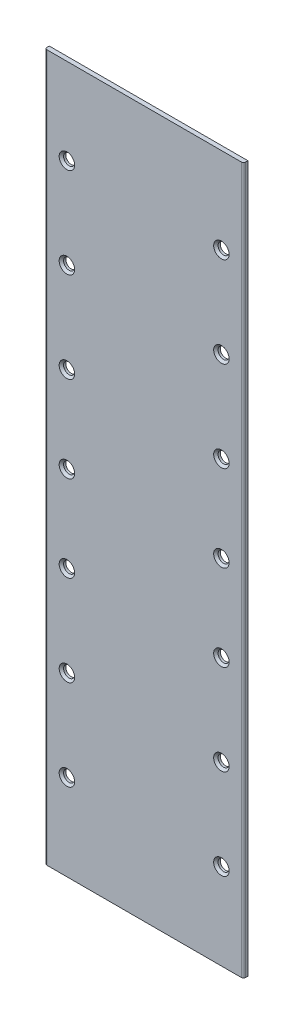
ISO-10303-21;
HEADER;
FILE_DESCRIPTION(('STEP AP214'),'2;1');
FILE_NAME('part.step','',(''),(''),'','','');
FILE_SCHEMA(('AUTOMOTIVE_DESIGN { 1 0 10303 214 1 1 1 1 }'));
ENDSEC;
DATA;
#1=APPLICATION_CONTEXT('core data for automotive mechanical design processes');
#2=APPLICATION_PROTOCOL_DEFINITION('international standard','automotive_design',2000,#1);
#3=PRODUCT_CONTEXT('',#1,'mechanical');
#4=PRODUCT('Part','Part','',(#3));
#5=PRODUCT_RELATED_PRODUCT_CATEGORY('part','',(#4));
#6=PRODUCT_DEFINITION_FORMATION('','',#4);
#7=PRODUCT_DEFINITION_CONTEXT('part definition',#1,'design');
#8=PRODUCT_DEFINITION('design','',#6,#7);
#9=PRODUCT_DEFINITION_SHAPE('','',#8);
#10=(LENGTH_UNIT() NAMED_UNIT(*) SI_UNIT(.MILLI.,.METRE.));
#11=(NAMED_UNIT(*) PLANE_ANGLE_UNIT() SI_UNIT($,.RADIAN.));
#12=(NAMED_UNIT(*) SI_UNIT($,.STERADIAN.) SOLID_ANGLE_UNIT());
#13=UNCERTAINTY_MEASURE_WITH_UNIT(LENGTH_MEASURE(1.E-05),#10,'distance_accuracy_value','');
#14=(GEOMETRIC_REPRESENTATION_CONTEXT(3) GLOBAL_UNCERTAINTY_ASSIGNED_CONTEXT((#13)) GLOBAL_UNIT_ASSIGNED_CONTEXT((#10,
#11,#12)) REPRESENTATION_CONTEXT('',''));
#15=CARTESIAN_POINT('',(0.,0.,0.));
#16=DIRECTION('',(0.,0.,1.));
#17=DIRECTION('',(1.,0.,0.));
#18=AXIS2_PLACEMENT_3D('',#15,#16,#17);
#19=CARTESIAN_POINT('',(0.,0.,2.));
#20=DIRECTION('',(0.,0.,-1.));
#21=DIRECTION('',(-1.,0.,0.));
#22=AXIS2_PLACEMENT_3D('',#19,#20,#21);
#23=PLANE('',#22);
#24=CARTESIAN_POINT('',(34.9999999999999,120.982014682888,2.));
#25=DIRECTION('',(0.,0.,-1.));
#26=DIRECTION('',(-1.,0.,0.));
#27=AXIS2_PLACEMENT_3D('',#24,#25,#26);
#28=CIRCLE('',#27,3.49999999999998);
#29=CARTESIAN_POINT('',(31.5,120.982014682888,2.));
#30=VERTEX_POINT('',#29);
#31=EDGE_CURVE('E275',#30,#30,#28,.T.);
#32=ORIENTED_EDGE('',*,*,#31,.T.);
#33=EDGE_LOOP('',(#32));
#34=FACE_BOUND('',#33,.T.);
#35=CARTESIAN_POINT('',(35.,80.,2.));
#36=DIRECTION('',(0.,0.,-1.));
#37=DIRECTION('',(-1.,0.,0.));
#38=AXIS2_PLACEMENT_3D('',#35,#36,#37);
#39=CIRCLE('',#38,3.49999999999998);
#40=CARTESIAN_POINT('',(31.5,80.,2.));
#41=VERTEX_POINT('',#40);
#42=EDGE_CURVE('E271',#41,#41,#39,.T.);
#43=ORIENTED_EDGE('',*,*,#42,.T.);
#44=EDGE_LOOP('',(#43));
#45=FACE_BOUND('',#44,.T.);
#46=CARTESIAN_POINT('',(34.9999999999999,39.0179853171119,2.));
#47=DIRECTION('',(0.,0.,-1.));
#48=DIRECTION('',(-1.,0.,0.));
#49=AXIS2_PLACEMENT_3D('',#46,#47,#48);
#50=CIRCLE('',#49,3.49999999999998);
#51=CARTESIAN_POINT('',(31.5,39.0179853171119,2.));
#52=VERTEX_POINT('',#51);
#53=EDGE_CURVE('E267',#52,#52,#50,.T.);
#54=ORIENTED_EDGE('',*,*,#53,.T.);
#55=EDGE_LOOP('',(#54));
#56=FACE_BOUND('',#55,.T.);
#57=CARTESIAN_POINT('',(35.,0.,2.));
#58=DIRECTION('',(0.,0.,-1.));
#59=DIRECTION('',(-1.,0.,0.));
#60=AXIS2_PLACEMENT_3D('',#57,#58,#59);
#61=CIRCLE('',#60,3.49999999999998);
#62=CARTESIAN_POINT('',(31.5,0.,2.));
#63=VERTEX_POINT('',#62);
#64=EDGE_CURVE('E263',#63,#63,#61,.T.);
#65=ORIENTED_EDGE('',*,*,#64,.T.);
#66=EDGE_LOOP('',(#65));
#67=FACE_BOUND('',#66,.T.);
#68=CARTESIAN_POINT('',(35.,-39.0179853171119,2.));
#69=DIRECTION('',(0.,0.,-1.));
#70=DIRECTION('',(-1.,0.,0.));
#71=AXIS2_PLACEMENT_3D('',#68,#69,#70);
#72=CIRCLE('',#71,3.49999999999998);
#73=CARTESIAN_POINT('',(31.5,-39.0179853171119,2.));
#74=VERTEX_POINT('',#73);
#75=EDGE_CURVE('E259',#74,#74,#72,.T.);
#76=ORIENTED_EDGE('',*,*,#75,.T.);
#77=EDGE_LOOP('',(#76));
#78=FACE_BOUND('',#77,.T.);
#79=CARTESIAN_POINT('',(35.,-80.,2.));
#80=DIRECTION('',(0.,0.,-1.));
#81=DIRECTION('',(-1.,0.,0.));
#82=AXIS2_PLACEMENT_3D('',#79,#80,#81);
#83=CIRCLE('',#82,3.49999999999998);
#84=CARTESIAN_POINT('',(31.5,-80.,2.));
#85=VERTEX_POINT('',#84);
#86=EDGE_CURVE('E255',#85,#85,#83,.T.);
#87=ORIENTED_EDGE('',*,*,#86,.T.);
#88=EDGE_LOOP('',(#87));
#89=FACE_BOUND('',#88,.T.);
#90=CARTESIAN_POINT('',(35.,-120.982014682888,2.));
#91=DIRECTION('',(0.,0.,-1.));
#92=DIRECTION('',(-1.,0.,0.));
#93=AXIS2_PLACEMENT_3D('',#90,#91,#92);
#94=CIRCLE('',#93,3.49999999999998);
#95=CARTESIAN_POINT('',(31.5,-120.982014682888,2.));
#96=VERTEX_POINT('',#95);
#97=EDGE_CURVE('E251',#96,#96,#94,.T.);
#98=ORIENTED_EDGE('',*,*,#97,.T.);
#99=EDGE_LOOP('',(#98));
#100=FACE_BOUND('',#99,.T.);
#101=CARTESIAN_POINT('',(-34.9999999999999,120.982014682888,2.));
#102=DIRECTION('',(0.,0.,-1.));
#103=DIRECTION('',(-1.,0.,0.));
#104=AXIS2_PLACEMENT_3D('',#101,#102,#103);
#105=CIRCLE('',#104,3.49999999999998);
#106=CARTESIAN_POINT('',(-38.4999999999999,120.982014682888,2.));
#107=VERTEX_POINT('',#106);
#108=EDGE_CURVE('E247',#107,#107,#105,.T.);
#109=ORIENTED_EDGE('',*,*,#108,.T.);
#110=EDGE_LOOP('',(#109));
#111=FACE_BOUND('',#110,.T.);
#112=CARTESIAN_POINT('',(-35.,80.,2.));
#113=DIRECTION('',(0.,0.,-1.));
#114=DIRECTION('',(-1.,0.,0.));
#115=AXIS2_PLACEMENT_3D('',#112,#113,#114);
#116=CIRCLE('',#115,3.49999999999998);
#117=CARTESIAN_POINT('',(-38.4999999999999,80.,2.));
#118=VERTEX_POINT('',#117);
#119=EDGE_CURVE('E243',#118,#118,#116,.T.);
#120=ORIENTED_EDGE('',*,*,#119,.T.);
#121=EDGE_LOOP('',(#120));
#122=FACE_BOUND('',#121,.T.);
#123=CARTESIAN_POINT('',(-34.9999999999999,39.0179853171119,2.));
#124=DIRECTION('',(0.,0.,-1.));
#125=DIRECTION('',(-1.,0.,0.));
#126=AXIS2_PLACEMENT_3D('',#123,#124,#125);
#127=CIRCLE('',#126,3.49999999999998);
#128=CARTESIAN_POINT('',(-38.4999999999999,39.0179853171119,2.));
#129=VERTEX_POINT('',#128);
#130=EDGE_CURVE('E239',#129,#129,#127,.T.);
#131=ORIENTED_EDGE('',*,*,#130,.T.);
#132=EDGE_LOOP('',(#131));
#133=FACE_BOUND('',#132,.T.);
#134=CARTESIAN_POINT('',(-35.,0.,2.));
#135=DIRECTION('',(0.,0.,-1.));
#136=DIRECTION('',(-1.,0.,0.));
#137=AXIS2_PLACEMENT_3D('',#134,#135,#136);
#138=CIRCLE('',#137,3.49999999999998);
#139=CARTESIAN_POINT('',(-38.4999999999999,0.,2.));
#140=VERTEX_POINT('',#139);
#141=EDGE_CURVE('E235',#140,#140,#138,.T.);
#142=ORIENTED_EDGE('',*,*,#141,.T.);
#143=EDGE_LOOP('',(#142));
#144=FACE_BOUND('',#143,.T.);
#145=CARTESIAN_POINT('',(-35.,-39.0179853171119,2.));
#146=DIRECTION('',(0.,0.,-1.));
#147=DIRECTION('',(-1.,0.,0.));
#148=AXIS2_PLACEMENT_3D('',#145,#146,#147);
#149=CIRCLE('',#148,3.49999999999998);
#150=CARTESIAN_POINT('',(-38.4999999999999,-39.0179853171119,2.));
#151=VERTEX_POINT('',#150);
#152=EDGE_CURVE('E231',#151,#151,#149,.T.);
#153=ORIENTED_EDGE('',*,*,#152,.T.);
#154=EDGE_LOOP('',(#153));
#155=FACE_BOUND('',#154,.T.);
#156=CARTESIAN_POINT('',(-35.,-80.,2.));
#157=DIRECTION('',(0.,0.,-1.));
#158=DIRECTION('',(-1.,0.,0.));
#159=AXIS2_PLACEMENT_3D('',#156,#157,#158);
#160=CIRCLE('',#159,3.49999999999998);
#161=CARTESIAN_POINT('',(-38.4999999999999,-80.,2.));
#162=VERTEX_POINT('',#161);
#163=EDGE_CURVE('E227',#162,#162,#160,.T.);
#164=ORIENTED_EDGE('',*,*,#163,.T.);
#165=EDGE_LOOP('',(#164));
#166=FACE_BOUND('',#165,.T.);
#167=CARTESIAN_POINT('',(-35.,-120.982014682888,2.));
#168=DIRECTION('',(0.,0.,-1.));
#169=DIRECTION('',(-1.,0.,0.));
#170=AXIS2_PLACEMENT_3D('',#167,#168,#169);
#171=CIRCLE('',#170,3.49999999999998);
#172=CARTESIAN_POINT('',(-38.4999999999999,-120.982014682888,2.));
#173=VERTEX_POINT('',#172);
#174=EDGE_CURVE('E223',#173,#173,#171,.T.);
#175=ORIENTED_EDGE('',*,*,#174,.T.);
#176=EDGE_LOOP('',(#175));
#177=FACE_BOUND('',#176,.T.);
#178=DIRECTION('',(-1.,0.,0.));
#179=VECTOR('',#178,1.);
#180=CARTESIAN_POINT('',(45.,160.,2.));
#181=LINE('',#180,#179);
#182=CARTESIAN_POINT('',(44.,160.,2.));
#183=VERTEX_POINT('',#182);
#184=CARTESIAN_POINT('',(-44.,160.,2.));
#185=VERTEX_POINT('',#184);
#186=EDGE_CURVE('E134',#183,#185,#181,.T.);
#187=ORIENTED_EDGE('',*,*,#186,.T.);
#188=DIRECTION('',(0.,-1.,0.));
#189=VECTOR('',#188,1.);
#190=CARTESIAN_POINT('',(-44.,0.,2.));
#191=LINE('',#190,#189);
#192=CARTESIAN_POINT('',(-43.9999999999999,-160.,2.));
#193=VERTEX_POINT('',#192);
#194=EDGE_CURVE('E204',#185,#193,#191,.T.);
#195=ORIENTED_EDGE('',*,*,#194,.T.);
#196=DIRECTION('',(1.,0.,0.));
#197=VECTOR('',#196,1.);
#198=CARTESIAN_POINT('',(45.,-160.,2.));
#199=LINE('',#198,#197);
#200=CARTESIAN_POINT('',(44.,-160.,2.));
#201=VERTEX_POINT('',#200);
#202=EDGE_CURVE('E142',#193,#201,#199,.T.);
#203=ORIENTED_EDGE('',*,*,#202,.T.);
#204=DIRECTION('',(0.,1.,0.));
#205=VECTOR('',#204,1.);
#206=CARTESIAN_POINT('',(44.,0.,2.));
#207=LINE('',#206,#205);
#208=EDGE_CURVE('E110',#201,#183,#207,.T.);
#209=ORIENTED_EDGE('',*,*,#208,.T.);
#210=EDGE_LOOP('',(#187,#195,#203,#209));
#211=FACE_BOUND('',#210,.T.);
#212=ADVANCED_FACE('F45',(#34,#45,#56,#67,#78,#89,#100,#111,#122,#133,#144,#155,#166,#177,#211),
#23,.F.);
#213=CARTESIAN_POINT('',(0.,0.,0.));
#214=DIRECTION('',(0.,0.,-1.));
#215=DIRECTION('',(-1.,0.,0.));
#216=AXIS2_PLACEMENT_3D('',#213,#214,#215);
#217=PLANE('',#216);
#218=CARTESIAN_POINT('',(-35.,-39.0179853171119,0.));
#219=DIRECTION('',(0.,0.,-1.));
#220=DIRECTION('',(-1.,0.,0.));
#221=AXIS2_PLACEMENT_3D('',#218,#219,#220);
#222=CIRCLE('',#221,2.5);
#223=CARTESIAN_POINT('',(-37.5,-39.0179853171119,0.));
#224=VERTEX_POINT('',#223);
#225=EDGE_CURVE('E127',#224,#224,#222,.T.);
#226=ORIENTED_EDGE('',*,*,#225,.F.);
#227=EDGE_LOOP('',(#226));
#228=FACE_BOUND('',#227,.T.);
#229=CARTESIAN_POINT('',(-34.9999999999999,39.0179853171119,0.));
#230=DIRECTION('',(0.,0.,-1.));
#231=DIRECTION('',(-1.,0.,0.));
#232=AXIS2_PLACEMENT_3D('',#229,#230,#231);
#233=CIRCLE('',#232,2.5);
#234=CARTESIAN_POINT('',(-37.4999999999999,39.0179853171119,0.));
#235=VERTEX_POINT('',#234);
#236=EDGE_CURVE('E186',#235,#235,#233,.F.);
#237=ORIENTED_EDGE('',*,*,#236,.T.);
#238=EDGE_LOOP('',(#237));
#239=FACE_BOUND('',#238,.T.);
#240=CARTESIAN_POINT('',(-35.,80.,0.));
#241=DIRECTION('',(0.,0.,-1.));
#242=DIRECTION('',(-1.,0.,0.));
#243=AXIS2_PLACEMENT_3D('',#240,#241,#242);
#244=CIRCLE('',#243,2.49999999999998);
#245=CARTESIAN_POINT('',(-37.4999999999999,80.,0.));
#246=VERTEX_POINT('',#245);
#247=EDGE_CURVE('E182',#246,#246,#244,.T.);
#248=ORIENTED_EDGE('',*,*,#247,.F.);
#249=EDGE_LOOP('',(#248));
#250=FACE_BOUND('',#249,.T.);
#251=CARTESIAN_POINT('',(35.,80.,0.));
#252=DIRECTION('',(0.,0.,-1.));
#253=DIRECTION('',(-1.,0.,0.));
#254=AXIS2_PLACEMENT_3D('',#251,#252,#253);
#255=CIRCLE('',#254,2.5);
#256=CARTESIAN_POINT('',(32.5,80.,0.));
#257=VERTEX_POINT('',#256);
#258=EDGE_CURVE('E178',#257,#257,#255,.T.);
#259=ORIENTED_EDGE('',*,*,#258,.F.);
#260=EDGE_LOOP('',(#259));
#261=FACE_BOUND('',#260,.T.);
#262=CARTESIAN_POINT('',(-35.,-120.982014682888,0.));
#263=DIRECTION('',(0.,0.,-1.));
#264=DIRECTION('',(-1.,0.,0.));
#265=AXIS2_PLACEMENT_3D('',#262,#263,#264);
#266=CIRCLE('',#265,2.5);
#267=CARTESIAN_POINT('',(-37.5,-120.982014682888,0.));
#268=VERTEX_POINT('',#267);
#269=EDGE_CURVE('E170',#268,#268,#266,.F.);
#270=ORIENTED_EDGE('',*,*,#269,.T.);
#271=EDGE_LOOP('',(#270));
#272=FACE_BOUND('',#271,.T.);
#273=CARTESIAN_POINT('',(-35.,-80.,0.));
#274=DIRECTION('',(0.,0.,-1.));
#275=DIRECTION('',(-1.,0.,0.));
#276=AXIS2_PLACEMENT_3D('',#273,#274,#275);
#277=CIRCLE('',#276,2.5);
#278=CARTESIAN_POINT('',(-37.5,-80.,0.));
#279=VERTEX_POINT('',#278);
#280=EDGE_CURVE('E158',#279,#279,#277,.F.);
#281=ORIENTED_EDGE('',*,*,#280,.T.);
#282=EDGE_LOOP('',(#281));
#283=FACE_BOUND('',#282,.T.);
#284=CARTESIAN_POINT('',(35.,-120.982014682888,0.));
#285=DIRECTION('',(0.,0.,-1.));
#286=DIRECTION('',(-1.,0.,0.));
#287=AXIS2_PLACEMENT_3D('',#284,#285,#286);
#288=CIRCLE('',#287,2.5);
#289=CARTESIAN_POINT('',(32.5,-120.982014682888,0.));
#290=VERTEX_POINT('',#289);
#291=EDGE_CURVE('E154',#290,#290,#288,.T.);
#292=ORIENTED_EDGE('',*,*,#291,.F.);
#293=EDGE_LOOP('',(#292));
#294=FACE_BOUND('',#293,.T.);
#295=CARTESIAN_POINT('',(-34.9999999999999,120.982014682888,0.));
#296=DIRECTION('',(0.,0.,-1.));
#297=DIRECTION('',(-1.,0.,0.));
#298=AXIS2_PLACEMENT_3D('',#295,#296,#297);
#299=CIRCLE('',#298,2.5);
#300=CARTESIAN_POINT('',(-37.4999999999999,120.982014682888,0.));
#301=VERTEX_POINT('',#300);
#302=EDGE_CURVE('E150',#301,#301,#299,.T.);
#303=ORIENTED_EDGE('',*,*,#302,.F.);
#304=EDGE_LOOP('',(#303));
#305=FACE_BOUND('',#304,.T.);
#306=DIRECTION('',(0.,-1.,0.));
#307=VECTOR('',#306,1.);
#308=CARTESIAN_POINT('',(-45.,160.,0.));
#309=LINE('',#308,#307);
#310=CARTESIAN_POINT('',(-45.,160.,0.));
#311=VERTEX_POINT('',#310);
#312=CARTESIAN_POINT('',(-45.,-160.,0.));
#313=VERTEX_POINT('',#312);
#314=EDGE_CURVE('E118',#311,#313,#309,.T.);
#315=ORIENTED_EDGE('',*,*,#314,.F.);
#316=DIRECTION('',(-1.,0.,0.));
#317=VECTOR('',#316,1.);
#318=CARTESIAN_POINT('',(45.,160.,0.));
#319=LINE('',#318,#317);
#320=CARTESIAN_POINT('',(45.,160.,0.));
#321=VERTEX_POINT('',#320);
#322=EDGE_CURVE('E139',#321,#311,#319,.T.);
#323=ORIENTED_EDGE('',*,*,#322,.F.);
#324=DIRECTION('',(0.,1.,0.));
#325=VECTOR('',#324,1.);
#326=CARTESIAN_POINT('',(45.,160.,0.));
#327=LINE('',#326,#325);
#328=CARTESIAN_POINT('',(45.,-160.,0.));
#329=VERTEX_POINT('',#328);
#330=EDGE_CURVE('E120',#329,#321,#327,.T.);
#331=ORIENTED_EDGE('',*,*,#330,.F.);
#332=DIRECTION('',(1.,0.,0.));
#333=VECTOR('',#332,1.);
#334=CARTESIAN_POINT('',(45.,-160.,0.));
#335=LINE('',#334,#333);
#336=EDGE_CURVE('E105',#313,#329,#335,.T.);
#337=ORIENTED_EDGE('',*,*,#336,.F.);
#338=EDGE_LOOP('',(#315,#323,#331,#337));
#339=FACE_BOUND('',#338,.T.);
#340=CARTESIAN_POINT('',(35.,-80.,0.));
#341=DIRECTION('',(0.,0.,-1.));
#342=DIRECTION('',(-1.,0.,0.));
#343=AXIS2_PLACEMENT_3D('',#340,#341,#342);
#344=CIRCLE('',#343,2.5);
#345=CARTESIAN_POINT('',(32.5,-80.,0.));
#346=VERTEX_POINT('',#345);
#347=EDGE_CURVE('E162',#346,#346,#344,.T.);
#348=ORIENTED_EDGE('',*,*,#347,.F.);
#349=EDGE_LOOP('',(#348));
#350=FACE_BOUND('',#349,.T.);
#351=CARTESIAN_POINT('',(35.,-39.0179853171119,0.));
#352=DIRECTION('',(0.,0.,-1.));
#353=DIRECTION('',(-1.,0.,0.));
#354=AXIS2_PLACEMENT_3D('',#351,#352,#353);
#355=CIRCLE('',#354,2.5);
#356=CARTESIAN_POINT('',(32.5,-39.0179853171119,0.));
#357=VERTEX_POINT('',#356);
#358=EDGE_CURVE('E166',#357,#357,#355,.F.);
#359=ORIENTED_EDGE('',*,*,#358,.T.);
#360=EDGE_LOOP('',(#359));
#361=FACE_BOUND('',#360,.T.);
#362=CARTESIAN_POINT('',(34.9999999999999,120.982014682888,0.));
#363=DIRECTION('',(0.,0.,-1.));
#364=DIRECTION('',(-1.,0.,0.));
#365=AXIS2_PLACEMENT_3D('',#362,#363,#364);
#366=CIRCLE('',#365,2.5);
#367=CARTESIAN_POINT('',(32.4999999999999,120.982014682888,0.));
#368=VERTEX_POINT('',#367);
#369=EDGE_CURVE('E174',#368,#368,#366,.F.);
#370=ORIENTED_EDGE('',*,*,#369,.T.);
#371=EDGE_LOOP('',(#370));
#372=FACE_BOUND('',#371,.T.);
#373=CARTESIAN_POINT('',(34.9999999999999,39.0179853171119,0.));
#374=DIRECTION('',(0.,0.,-1.));
#375=DIRECTION('',(-1.,0.,0.));
#376=AXIS2_PLACEMENT_3D('',#373,#374,#375);
#377=CIRCLE('',#376,2.5);
#378=CARTESIAN_POINT('',(32.4999999999999,39.0179853171119,0.));
#379=VERTEX_POINT('',#378);
#380=EDGE_CURVE('E190',#379,#379,#377,.T.);
#381=ORIENTED_EDGE('',*,*,#380,.F.);
#382=EDGE_LOOP('',(#381));
#383=FACE_BOUND('',#382,.T.);
#384=CARTESIAN_POINT('',(35.,0.,0.));
#385=DIRECTION('',(0.,0.,-1.));
#386=DIRECTION('',(-1.,0.,0.));
#387=AXIS2_PLACEMENT_3D('',#384,#385,#386);
#388=CIRCLE('',#387,2.5);
#389=CARTESIAN_POINT('',(32.5,0.,0.));
#390=VERTEX_POINT('',#389);
#391=EDGE_CURVE('E194',#390,#390,#388,.T.);
#392=ORIENTED_EDGE('',*,*,#391,.F.);
#393=EDGE_LOOP('',(#392));
#394=FACE_BOUND('',#393,.T.);
#395=CARTESIAN_POINT('',(-35.,0.,0.));
#396=DIRECTION('',(0.,0.,-1.));
#397=DIRECTION('',(-1.,0.,0.));
#398=AXIS2_PLACEMENT_3D('',#395,#396,#397);
#399=CIRCLE('',#398,2.5);
#400=CARTESIAN_POINT('',(-37.5,0.,0.));
#401=VERTEX_POINT('',#400);
#402=EDGE_CURVE('E131',#401,#401,#399,.F.);
#403=ORIENTED_EDGE('',*,*,#402,.T.);
#404=EDGE_LOOP('',(#403));
#405=FACE_BOUND('',#404,.T.);
#406=ADVANCED_FACE('F115',(#228,#239,#250,#261,#272,#283,#294,#305,#339,#350,#361,#372,#383,
#394,#405),#217,.T.);
#407=CARTESIAN_POINT('',(-45.,160.,2.));
#408=DIRECTION('',(1.,0.,0.));
#409=DIRECTION('',(0.,1.,0.));
#410=AXIS2_PLACEMENT_3D('',#407,#408,#409);
#411=PLANE('',#410);
#412=DIRECTION('',(0.,0.,-1.));
#413=VECTOR('',#412,1.);
#414=CARTESIAN_POINT('',(-45.,-160.,2.));
#415=LINE('',#414,#413);
#416=CARTESIAN_POINT('',(-45.,-160.,1.));
#417=VERTEX_POINT('',#416);
#418=EDGE_CURVE('E100',#417,#313,#415,.T.);
#419=ORIENTED_EDGE('',*,*,#418,.F.);
#420=DIRECTION('',(0.,-1.,0.));
#421=VECTOR('',#420,1.);
#422=CARTESIAN_POINT('',(-45.,160.,1.));
#423=LINE('',#422,#421);
#424=CARTESIAN_POINT('',(-45.,160.,1.));
#425=VERTEX_POINT('',#424);
#426=EDGE_CURVE('E70',#417,#425,#423,.F.);
#427=ORIENTED_EDGE('',*,*,#426,.T.);
#428=DIRECTION('',(0.,0.,-1.));
#429=VECTOR('',#428,1.);
#430=CARTESIAN_POINT('',(-45.,160.,2.));
#431=LINE('',#430,#429);
#432=EDGE_CURVE('E124',#425,#311,#431,.T.);
#433=ORIENTED_EDGE('',*,*,#432,.T.);
#434=ORIENTED_EDGE('',*,*,#314,.T.);
#435=EDGE_LOOP('',(#419,#427,#433,#434));
#436=FACE_BOUND('',#435,.T.);
#437=ADVANCED_FACE('F123',(#436),#411,.F.);
#438=CARTESIAN_POINT('',(45.,-160.,2.));
#439=DIRECTION('',(0.,1.,0.));
#440=DIRECTION('',(0.,0.,1.));
#441=AXIS2_PLACEMENT_3D('',#438,#439,#440);
#442=PLANE('',#441);
#443=ORIENTED_EDGE('',*,*,#202,.F.);
#444=CARTESIAN_POINT('',(-44.,-160.,1.));
#445=DIRECTION('',(0.,1.,0.));
#446=DIRECTION('',(0.,0.,1.));
#447=AXIS2_PLACEMENT_3D('',#444,#445,#446);
#448=CIRCLE('',#447,1.);
#449=EDGE_CURVE('E107',#193,#417,#448,.F.);
#450=ORIENTED_EDGE('',*,*,#449,.T.);
#451=ORIENTED_EDGE('',*,*,#418,.T.);
#452=ORIENTED_EDGE('',*,*,#336,.T.);
#453=DIRECTION('',(0.,0.,-1.));
#454=VECTOR('',#453,1.);
#455=CARTESIAN_POINT('',(45.,-160.,2.));
#456=LINE('',#455,#454);
#457=CARTESIAN_POINT('',(45.,-160.,1.));
#458=VERTEX_POINT('',#457);
#459=EDGE_CURVE('E111',#458,#329,#456,.T.);
#460=ORIENTED_EDGE('',*,*,#459,.F.);
#461=CARTESIAN_POINT('',(44.,-160.,1.));
#462=DIRECTION('',(0.,1.,0.));
#463=DIRECTION('',(0.,0.,1.));
#464=AXIS2_PLACEMENT_3D('',#461,#462,#463);
#465=CIRCLE('',#464,1.);
#466=EDGE_CURVE('E208',#458,#201,#465,.F.);
#467=ORIENTED_EDGE('',*,*,#466,.T.);
#468=EDGE_LOOP('',(#443,#450,#451,#452,#460,#467));
#469=FACE_BOUND('',#468,.T.);
#470=ADVANCED_FACE('F103',(#469),#442,.F.);
#471=CARTESIAN_POINT('',(45.,160.,2.));
#472=DIRECTION('',(-1.,0.,0.));
#473=DIRECTION('',(0.,-1.,0.));
#474=AXIS2_PLACEMENT_3D('',#471,#472,#473);
#475=PLANE('',#474);
#476=DIRECTION('',(0.,0.,-1.));
#477=VECTOR('',#476,1.);
#478=CARTESIAN_POINT('',(45.,160.,2.));
#479=LINE('',#478,#477);
#480=CARTESIAN_POINT('',(45.,160.,1.));
#481=VERTEX_POINT('',#480);
#482=EDGE_CURVE('E145',#481,#321,#479,.T.);
#483=ORIENTED_EDGE('',*,*,#482,.F.);
#484=DIRECTION('',(0.,1.,0.));
#485=VECTOR('',#484,1.);
#486=CARTESIAN_POINT('',(45.,160.,1.));
#487=LINE('',#486,#485);
#488=EDGE_CURVE('E220',#481,#458,#487,.F.);
#489=ORIENTED_EDGE('',*,*,#488,.T.);
#490=ORIENTED_EDGE('',*,*,#459,.T.);
#491=ORIENTED_EDGE('',*,*,#330,.T.);
#492=EDGE_LOOP('',(#483,#489,#490,#491));
#493=FACE_BOUND('',#492,.T.);
#494=ADVANCED_FACE('F356',(#493),#475,.F.);
#495=CARTESIAN_POINT('',(45.,160.,2.));
#496=DIRECTION('',(0.,-1.,0.));
#497=DIRECTION('',(1.,0.,0.));
#498=AXIS2_PLACEMENT_3D('',#495,#496,#497);
#499=PLANE('',#498);
#500=ORIENTED_EDGE('',*,*,#432,.F.);
#501=CARTESIAN_POINT('',(-44.,160.,1.));
#502=DIRECTION('',(0.,-1.,0.));
#503=DIRECTION('',(1.,0.,0.));
#504=AXIS2_PLACEMENT_3D('',#501,#502,#503);
#505=CIRCLE('',#504,1.);
#506=EDGE_CURVE('E217',#425,#185,#505,.F.);
#507=ORIENTED_EDGE('',*,*,#506,.T.);
#508=ORIENTED_EDGE('',*,*,#186,.F.);
#509=CARTESIAN_POINT('',(44.,160.,1.));
#510=DIRECTION('',(0.,-1.,0.));
#511=DIRECTION('',(1.,0.,0.));
#512=AXIS2_PLACEMENT_3D('',#509,#510,#511);
#513=CIRCLE('',#512,1.);
#514=EDGE_CURVE('E62',#183,#481,#513,.F.);
#515=ORIENTED_EDGE('',*,*,#514,.T.);
#516=ORIENTED_EDGE('',*,*,#482,.T.);
#517=ORIENTED_EDGE('',*,*,#322,.T.);
#518=EDGE_LOOP('',(#500,#507,#508,#515,#516,#517));
#519=FACE_BOUND('',#518,.T.);
#520=ADVANCED_FACE('F353',(#519),#499,.F.);
#521=CARTESIAN_POINT('',(-34.9999999999999,120.982014682888,-43.));
#522=DIRECTION('',(0.,0.,1.));
#523=DIRECTION('',(1.,0.,0.));
#524=AXIS2_PLACEMENT_3D('',#521,#522,#523);
#525=CYLINDRICAL_SURFACE('',#524,2.5);
#526=CARTESIAN_POINT('',(-34.9999999999999,120.982014682888,1.));
#527=DIRECTION('',(0.,0.,-1.));
#528=DIRECTION('',(-1.,0.,0.));
#529=AXIS2_PLACEMENT_3D('',#526,#527,#528);
#530=CIRCLE('',#529,2.5);
#531=CARTESIAN_POINT('',(-37.4999999999999,120.982014682888,1.));
#532=VERTEX_POINT('',#531);
#533=EDGE_CURVE('E307',#532,#532,#530,.F.);
#534=ORIENTED_EDGE('',*,*,#533,.T.);
#535=EDGE_LOOP('',(#534));
#536=FACE_BOUND('',#535,.T.);
#537=ORIENTED_EDGE('',*,*,#302,.T.);
#538=EDGE_LOOP('',(#537));
#539=FACE_BOUND('',#538,.T.);
#540=ADVANCED_FACE('F485',(#536,#539),#525,.F.);
#541=CARTESIAN_POINT('',(35.,-120.982014682888,-43.));
#542=DIRECTION('',(0.,0.,1.));
#543=DIRECTION('',(1.,0.,0.));
#544=AXIS2_PLACEMENT_3D('',#541,#542,#543);
#545=CYLINDRICAL_SURFACE('',#544,2.5);
#546=CARTESIAN_POINT('',(35.,-120.982014682888,1.));
#547=DIRECTION('',(0.,0.,-1.));
#548=DIRECTION('',(-1.,0.,0.));
#549=AXIS2_PLACEMENT_3D('',#546,#547,#548);
#550=CIRCLE('',#549,2.5);
#551=CARTESIAN_POINT('',(32.5,-120.982014682888,1.));
#552=VERTEX_POINT('',#551);
#553=EDGE_CURVE('E303',#552,#552,#550,.F.);
#554=ORIENTED_EDGE('',*,*,#553,.T.);
#555=EDGE_LOOP('',(#554));
#556=FACE_BOUND('',#555,.T.);
#557=ORIENTED_EDGE('',*,*,#291,.T.);
#558=EDGE_LOOP('',(#557));
#559=FACE_BOUND('',#558,.T.);
#560=ADVANCED_FACE('F487',(#556,#559),#545,.F.);
#561=CARTESIAN_POINT('',(-35.,-80.,-43.));
#562=DIRECTION('',(0.,0.,1.));
#563=DIRECTION('',(1.,0.,0.));
#564=AXIS2_PLACEMENT_3D('',#561,#562,#563);
#565=CYLINDRICAL_SURFACE('',#564,2.5);
#566=CARTESIAN_POINT('',(-35.,-80.,1.));
#567=DIRECTION('',(0.,0.,-1.));
#568=DIRECTION('',(-1.,0.,0.));
#569=AXIS2_PLACEMENT_3D('',#566,#567,#568);
#570=CIRCLE('',#569,2.5);
#571=CARTESIAN_POINT('',(-37.5,-80.,1.));
#572=VERTEX_POINT('',#571);
#573=EDGE_CURVE('E55',#572,#572,#570,.F.);
#574=ORIENTED_EDGE('',*,*,#573,.T.);
#575=EDGE_LOOP('',(#574));
#576=FACE_BOUND('',#575,.T.);
#577=ORIENTED_EDGE('',*,*,#280,.F.);
#578=EDGE_LOOP('',(#577));
#579=FACE_BOUND('',#578,.T.);
#580=ADVANCED_FACE('F330',(#576,#579),#565,.F.);
#581=CARTESIAN_POINT('',(35.,-80.,-43.));
#582=DIRECTION('',(0.,0.,1.));
#583=DIRECTION('',(1.,0.,0.));
#584=AXIS2_PLACEMENT_3D('',#581,#582,#583);
#585=CYLINDRICAL_SURFACE('',#584,2.5);
#586=CARTESIAN_POINT('',(35.,-80.,1.));
#587=DIRECTION('',(0.,0.,-1.));
#588=DIRECTION('',(-1.,0.,0.));
#589=AXIS2_PLACEMENT_3D('',#586,#587,#588);
#590=CIRCLE('',#589,2.5);
#591=CARTESIAN_POINT('',(32.5,-80.,1.));
#592=VERTEX_POINT('',#591);
#593=EDGE_CURVE('E299',#592,#592,#590,.F.);
#594=ORIENTED_EDGE('',*,*,#593,.T.);
#595=EDGE_LOOP('',(#594));
#596=FACE_BOUND('',#595,.T.);
#597=ORIENTED_EDGE('',*,*,#347,.T.);
#598=EDGE_LOOP('',(#597));
#599=FACE_BOUND('',#598,.T.);
#600=ADVANCED_FACE('F565',(#596,#599),#585,.F.);
#601=CARTESIAN_POINT('',(35.,-39.0179853171119,-43.));
#602=DIRECTION('',(0.,0.,1.));
#603=DIRECTION('',(1.,0.,0.));
#604=AXIS2_PLACEMENT_3D('',#601,#602,#603);
#605=CYLINDRICAL_SURFACE('',#604,2.5);
#606=CARTESIAN_POINT('',(35.,-39.0179853171119,1.));
#607=DIRECTION('',(0.,0.,-1.));
#608=DIRECTION('',(-1.,0.,0.));
#609=AXIS2_PLACEMENT_3D('',#606,#607,#608);
#610=CIRCLE('',#609,2.5);
#611=CARTESIAN_POINT('',(32.5,-39.0179853171119,1.));
#612=VERTEX_POINT('',#611);
#613=EDGE_CURVE('E295',#612,#612,#610,.F.);
#614=ORIENTED_EDGE('',*,*,#613,.T.);
#615=EDGE_LOOP('',(#614));
#616=FACE_BOUND('',#615,.T.);
#617=ORIENTED_EDGE('',*,*,#358,.F.);
#618=EDGE_LOOP('',(#617));
#619=FACE_BOUND('',#618,.T.);
#620=ADVANCED_FACE('F575',(#616,#619),#605,.F.);
#621=CARTESIAN_POINT('',(-35.,-120.982014682888,-43.));
#622=DIRECTION('',(0.,0.,1.));
#623=DIRECTION('',(1.,0.,0.));
#624=AXIS2_PLACEMENT_3D('',#621,#622,#623);
#625=CYLINDRICAL_SURFACE('',#624,2.5);
#626=CARTESIAN_POINT('',(-35.,-120.982014682888,1.));
#627=DIRECTION('',(0.,0.,-1.));
#628=DIRECTION('',(-1.,0.,0.));
#629=AXIS2_PLACEMENT_3D('',#626,#627,#628);
#630=CIRCLE('',#629,2.5);
#631=CARTESIAN_POINT('',(-37.5,-120.982014682888,1.));
#632=VERTEX_POINT('',#631);
#633=EDGE_CURVE('E11',#632,#632,#630,.F.);
#634=ORIENTED_EDGE('',*,*,#633,.T.);
#635=EDGE_LOOP('',(#634));
#636=FACE_BOUND('',#635,.T.);
#637=ORIENTED_EDGE('',*,*,#269,.F.);
#638=EDGE_LOOP('',(#637));
#639=FACE_BOUND('',#638,.T.);
#640=ADVANCED_FACE('F586',(#636,#639),#625,.F.);
#641=CARTESIAN_POINT('',(34.9999999999999,120.982014682888,-43.));
#642=DIRECTION('',(0.,0.,1.));
#643=DIRECTION('',(1.,0.,0.));
#644=AXIS2_PLACEMENT_3D('',#641,#642,#643);
#645=CYLINDRICAL_SURFACE('',#644,2.5);
#646=CARTESIAN_POINT('',(34.9999999999999,120.982014682888,1.));
#647=DIRECTION('',(0.,0.,-1.));
#648=DIRECTION('',(-1.,0.,0.));
#649=AXIS2_PLACEMENT_3D('',#646,#647,#648);
#650=CIRCLE('',#649,2.5);
#651=CARTESIAN_POINT('',(32.4999999999999,120.982014682888,1.));
#652=VERTEX_POINT('',#651);
#653=EDGE_CURVE('E279',#652,#652,#650,.F.);
#654=ORIENTED_EDGE('',*,*,#653,.T.);
#655=EDGE_LOOP('',(#654));
#656=FACE_BOUND('',#655,.T.);
#657=ORIENTED_EDGE('',*,*,#369,.F.);
#658=EDGE_LOOP('',(#657));
#659=FACE_BOUND('',#658,.T.);
#660=ADVANCED_FACE('F597',(#656,#659),#645,.F.);
#661=CARTESIAN_POINT('',(35.,80.,-43.));
#662=DIRECTION('',(0.,0.,1.));
#663=DIRECTION('',(1.,0.,0.));
#664=AXIS2_PLACEMENT_3D('',#661,#662,#663);
#665=CYLINDRICAL_SURFACE('',#664,2.5);
#666=CARTESIAN_POINT('',(35.,80.,1.));
#667=DIRECTION('',(0.,0.,-1.));
#668=DIRECTION('',(-1.,0.,0.));
#669=AXIS2_PLACEMENT_3D('',#666,#667,#668);
#670=CIRCLE('',#669,2.5);
#671=CARTESIAN_POINT('',(32.5,80.,1.));
#672=VERTEX_POINT('',#671);
#673=EDGE_CURVE('E283',#672,#672,#670,.F.);
#674=ORIENTED_EDGE('',*,*,#673,.T.);
#675=EDGE_LOOP('',(#674));
#676=FACE_BOUND('',#675,.T.);
#677=ORIENTED_EDGE('',*,*,#258,.T.);
#678=EDGE_LOOP('',(#677));
#679=FACE_BOUND('',#678,.T.);
#680=ADVANCED_FACE('F608',(#676,#679),#665,.F.);
#681=CARTESIAN_POINT('',(-35.,80.,-43.));
#682=DIRECTION('',(0.,0.,1.));
#683=DIRECTION('',(1.,0.,0.));
#684=AXIS2_PLACEMENT_3D('',#681,#682,#683);
#685=CYLINDRICAL_SURFACE('',#684,2.49999999999998);
#686=CARTESIAN_POINT('',(-35.,80.,0.999999999999973));
#687=DIRECTION('',(0.,0.,-1.));
#688=DIRECTION('',(-1.,0.,0.));
#689=AXIS2_PLACEMENT_3D('',#686,#687,#688);
#690=CIRCLE('',#689,2.49999999999998);
#691=CARTESIAN_POINT('',(-37.4999999999999,80.,0.999999999999973));
#692=VERTEX_POINT('',#691);
#693=EDGE_CURVE('E311',#692,#692,#690,.F.);
#694=ORIENTED_EDGE('',*,*,#693,.T.);
#695=EDGE_LOOP('',(#694));
#696=FACE_BOUND('',#695,.T.);
#697=ORIENTED_EDGE('',*,*,#247,.T.);
#698=EDGE_LOOP('',(#697));
#699=FACE_BOUND('',#698,.T.);
#700=ADVANCED_FACE('F620',(#696,#699),#685,.F.);
#701=CARTESIAN_POINT('',(-34.9999999999999,39.0179853171119,-43.));
#702=DIRECTION('',(0.,0.,1.));
#703=DIRECTION('',(1.,0.,0.));
#704=AXIS2_PLACEMENT_3D('',#701,#702,#703);
#705=CYLINDRICAL_SURFACE('',#704,2.5);
#706=CARTESIAN_POINT('',(-34.9999999999999,39.0179853171119,1.));
#707=DIRECTION('',(0.,0.,-1.));
#708=DIRECTION('',(-1.,0.,0.));
#709=AXIS2_PLACEMENT_3D('',#706,#707,#708);
#710=CIRCLE('',#709,2.5);
#711=CARTESIAN_POINT('',(-37.4999999999999,39.0179853171119,1.));
#712=VERTEX_POINT('',#711);
#713=EDGE_CURVE('E315',#712,#712,#710,.F.);
#714=ORIENTED_EDGE('',*,*,#713,.T.);
#715=EDGE_LOOP('',(#714));
#716=FACE_BOUND('',#715,.T.);
#717=ORIENTED_EDGE('',*,*,#236,.F.);
#718=EDGE_LOOP('',(#717));
#719=FACE_BOUND('',#718,.T.);
#720=ADVANCED_FACE('F498',(#716,#719),#705,.F.);
#721=CARTESIAN_POINT('',(34.9999999999999,39.0179853171119,-43.));
#722=DIRECTION('',(0.,0.,1.));
#723=DIRECTION('',(1.,0.,0.));
#724=AXIS2_PLACEMENT_3D('',#721,#722,#723);
#725=CYLINDRICAL_SURFACE('',#724,2.5);
#726=CARTESIAN_POINT('',(34.9999999999999,39.0179853171119,1.));
#727=DIRECTION('',(0.,0.,-1.));
#728=DIRECTION('',(-1.,0.,0.));
#729=AXIS2_PLACEMENT_3D('',#726,#727,#728);
#730=CIRCLE('',#729,2.5);
#731=CARTESIAN_POINT('',(32.4999999999999,39.0179853171119,1.));
#732=VERTEX_POINT('',#731);
#733=EDGE_CURVE('E287',#732,#732,#730,.F.);
#734=ORIENTED_EDGE('',*,*,#733,.T.);
#735=EDGE_LOOP('',(#734));
#736=FACE_BOUND('',#735,.T.);
#737=ORIENTED_EDGE('',*,*,#380,.T.);
#738=EDGE_LOOP('',(#737));
#739=FACE_BOUND('',#738,.T.);
#740=ADVANCED_FACE('F639',(#736,#739),#725,.F.);
#741=CARTESIAN_POINT('',(35.,0.,-43.));
#742=DIRECTION('',(0.,0.,1.));
#743=DIRECTION('',(1.,0.,0.));
#744=AXIS2_PLACEMENT_3D('',#741,#742,#743);
#745=CYLINDRICAL_SURFACE('',#744,2.5);
#746=CARTESIAN_POINT('',(35.,0.,1.));
#747=DIRECTION('',(0.,0.,-1.));
#748=DIRECTION('',(-1.,0.,0.));
#749=AXIS2_PLACEMENT_3D('',#746,#747,#748);
#750=CIRCLE('',#749,2.5);
#751=CARTESIAN_POINT('',(32.5,0.,1.));
#752=VERTEX_POINT('',#751);
#753=EDGE_CURVE('E291',#752,#752,#750,.F.);
#754=ORIENTED_EDGE('',*,*,#753,.T.);
#755=EDGE_LOOP('',(#754));
#756=FACE_BOUND('',#755,.T.);
#757=ORIENTED_EDGE('',*,*,#391,.T.);
#758=EDGE_LOOP('',(#757));
#759=FACE_BOUND('',#758,.T.);
#760=ADVANCED_FACE('F649',(#756,#759),#745,.F.);
#761=CARTESIAN_POINT('',(-35.,0.,-43.));
#762=DIRECTION('',(0.,0.,1.));
#763=DIRECTION('',(1.,0.,0.));
#764=AXIS2_PLACEMENT_3D('',#761,#762,#763);
#765=CYLINDRICAL_SURFACE('',#764,2.5);
#766=CARTESIAN_POINT('',(-35.,0.,1.));
#767=DIRECTION('',(0.,0.,-1.));
#768=DIRECTION('',(-1.,0.,0.));
#769=AXIS2_PLACEMENT_3D('',#766,#767,#768);
#770=CIRCLE('',#769,2.5);
#771=CARTESIAN_POINT('',(-37.5,0.,1.));
#772=VERTEX_POINT('',#771);
#773=EDGE_CURVE('E319',#772,#772,#770,.F.);
#774=ORIENTED_EDGE('',*,*,#773,.T.);
#775=EDGE_LOOP('',(#774));
#776=FACE_BOUND('',#775,.T.);
#777=ORIENTED_EDGE('',*,*,#402,.F.);
#778=EDGE_LOOP('',(#777));
#779=FACE_BOUND('',#778,.T.);
#780=ADVANCED_FACE('F464',(#776,#779),#765,.F.);
#781=CARTESIAN_POINT('',(-35.,-39.0179853171119,-43.));
#782=DIRECTION('',(0.,0.,1.));
#783=DIRECTION('',(1.,0.,0.));
#784=AXIS2_PLACEMENT_3D('',#781,#782,#783);
#785=CYLINDRICAL_SURFACE('',#784,2.5);
#786=CARTESIAN_POINT('',(-35.,-39.0179853171119,1.));
#787=DIRECTION('',(0.,0.,-1.));
#788=DIRECTION('',(-1.,0.,0.));
#789=AXIS2_PLACEMENT_3D('',#786,#787,#788);
#790=CIRCLE('',#789,2.5);
#791=CARTESIAN_POINT('',(-37.5,-39.0179853171119,1.));
#792=VERTEX_POINT('',#791);
#793=EDGE_CURVE('E323',#792,#792,#790,.F.);
#794=ORIENTED_EDGE('',*,*,#793,.T.);
#795=EDGE_LOOP('',(#794));
#796=FACE_BOUND('',#795,.T.);
#797=ORIENTED_EDGE('',*,*,#225,.T.);
#798=EDGE_LOOP('',(#797));
#799=FACE_BOUND('',#798,.T.);
#800=ADVANCED_FACE('F370',(#796,#799),#785,.F.);
#801=CARTESIAN_POINT('',(-44.,0.,1.));
#802=DIRECTION('',(0.,-1.,0.));
#803=DIRECTION('',(1.,0.,0.));
#804=AXIS2_PLACEMENT_3D('',#801,#802,#803);
#805=CYLINDRICAL_SURFACE('',#804,1.);
#806=ORIENTED_EDGE('',*,*,#506,.F.);
#807=ORIENTED_EDGE('',*,*,#426,.F.);
#808=ORIENTED_EDGE('',*,*,#449,.F.);
#809=ORIENTED_EDGE('',*,*,#194,.F.);
#810=EDGE_LOOP('',(#806,#807,#808,#809));
#811=FACE_BOUND('',#810,.T.);
#812=ADVANCED_FACE('F352',(#811),#805,.T.);
#813=CARTESIAN_POINT('',(44.,0.,1.));
#814=DIRECTION('',(0.,1.,0.));
#815=DIRECTION('',(-1.,0.,0.));
#816=AXIS2_PLACEMENT_3D('',#813,#814,#815);
#817=CYLINDRICAL_SURFACE('',#816,1.);
#818=ORIENTED_EDGE('',*,*,#466,.F.);
#819=ORIENTED_EDGE('',*,*,#488,.F.);
#820=ORIENTED_EDGE('',*,*,#514,.F.);
#821=ORIENTED_EDGE('',*,*,#208,.F.);
#822=EDGE_LOOP('',(#818,#819,#820,#821));
#823=FACE_BOUND('',#822,.T.);
#824=ADVANCED_FACE('F359',(#823),#817,.T.);
#825=CARTESIAN_POINT('',(34.9999999999999,120.982014682888,2.));
#826=DIRECTION('',(0.,0.,1.));
#827=DIRECTION('',(1.,0.,0.));
#828=AXIS2_PLACEMENT_3D('',#825,#826,#827);
#829=CONICAL_SURFACE('',#828,3.49999999999998,0.785398163397434);
#830=ORIENTED_EDGE('',*,*,#653,.F.);
#831=EDGE_LOOP('',(#830));
#832=FACE_BOUND('',#831,.T.);
#833=ORIENTED_EDGE('',*,*,#31,.F.);
#834=EDGE_LOOP('',(#833));
#835=FACE_BOUND('',#834,.T.);
#836=ADVANCED_FACE('F361',(#832,#835),#829,.F.);
#837=CARTESIAN_POINT('',(35.,80.,1.));
#838=DIRECTION('',(0.,0.,1.));
#839=DIRECTION('',(1.,0.,0.));
#840=AXIS2_PLACEMENT_3D('',#837,#838,#839);
#841=CONICAL_SURFACE('',#840,2.5,0.785398163397434);
#842=ORIENTED_EDGE('',*,*,#42,.F.);
#843=EDGE_LOOP('',(#842));
#844=FACE_BOUND('',#843,.T.);
#845=ORIENTED_EDGE('',*,*,#673,.F.);
#846=EDGE_LOOP('',(#845));
#847=FACE_BOUND('',#846,.T.);
#848=ADVANCED_FACE('F367',(#844,#847),#841,.F.);
#849=CARTESIAN_POINT('',(34.9999999999999,39.0179853171119,1.));
#850=DIRECTION('',(0.,0.,1.));
#851=DIRECTION('',(1.,0.,0.));
#852=AXIS2_PLACEMENT_3D('',#849,#850,#851);
#853=CONICAL_SURFACE('',#852,2.5,0.785398163397434);
#854=ORIENTED_EDGE('',*,*,#53,.F.);
#855=EDGE_LOOP('',(#854));
#856=FACE_BOUND('',#855,.T.);
#857=ORIENTED_EDGE('',*,*,#733,.F.);
#858=EDGE_LOOP('',(#857));
#859=FACE_BOUND('',#858,.T.);
#860=ADVANCED_FACE('F383',(#856,#859),#853,.F.);
#861=CARTESIAN_POINT('',(35.,0.,1.));
#862=DIRECTION('',(0.,0.,1.));
#863=DIRECTION('',(1.,0.,0.));
#864=AXIS2_PLACEMENT_3D('',#861,#862,#863);
#865=CONICAL_SURFACE('',#864,2.5,0.785398163397435);
#866=ORIENTED_EDGE('',*,*,#64,.F.);
#867=EDGE_LOOP('',(#866));
#868=FACE_BOUND('',#867,.T.);
#869=ORIENTED_EDGE('',*,*,#753,.F.);
#870=EDGE_LOOP('',(#869));
#871=FACE_BOUND('',#870,.T.);
#872=ADVANCED_FACE('F390',(#868,#871),#865,.F.);
#873=CARTESIAN_POINT('',(35.,-39.0179853171119,2.));
#874=DIRECTION('',(0.,0.,1.));
#875=DIRECTION('',(1.,0.,0.));
#876=AXIS2_PLACEMENT_3D('',#873,#874,#875);
#877=CONICAL_SURFACE('',#876,3.49999999999998,0.785398163397434);
#878=ORIENTED_EDGE('',*,*,#613,.F.);
#879=EDGE_LOOP('',(#878));
#880=FACE_BOUND('',#879,.T.);
#881=ORIENTED_EDGE('',*,*,#75,.F.);
#882=EDGE_LOOP('',(#881));
#883=FACE_BOUND('',#882,.T.);
#884=ADVANCED_FACE('F397',(#880,#883),#877,.F.);
#885=CARTESIAN_POINT('',(35.,-80.,1.));
#886=DIRECTION('',(0.,0.,1.));
#887=DIRECTION('',(1.,0.,0.));
#888=AXIS2_PLACEMENT_3D('',#885,#886,#887);
#889=CONICAL_SURFACE('',#888,2.5,0.785398163397434);
#890=ORIENTED_EDGE('',*,*,#86,.F.);
#891=EDGE_LOOP('',(#890));
#892=FACE_BOUND('',#891,.T.);
#893=ORIENTED_EDGE('',*,*,#593,.F.);
#894=EDGE_LOOP('',(#893));
#895=FACE_BOUND('',#894,.T.);
#896=ADVANCED_FACE('F404',(#892,#895),#889,.F.);
#897=CARTESIAN_POINT('',(35.,-120.982014682888,1.));
#898=DIRECTION('',(0.,0.,1.));
#899=DIRECTION('',(1.,0.,0.));
#900=AXIS2_PLACEMENT_3D('',#897,#898,#899);
#901=CONICAL_SURFACE('',#900,2.5,0.785398163397434);
#902=ORIENTED_EDGE('',*,*,#97,.F.);
#903=EDGE_LOOP('',(#902));
#904=FACE_BOUND('',#903,.T.);
#905=ORIENTED_EDGE('',*,*,#553,.F.);
#906=EDGE_LOOP('',(#905));
#907=FACE_BOUND('',#906,.T.);
#908=ADVANCED_FACE('F411',(#904,#907),#901,.F.);
#909=CARTESIAN_POINT('',(-34.9999999999999,120.982014682888,1.));
#910=DIRECTION('',(0.,0.,1.));
#911=DIRECTION('',(1.,0.,0.));
#912=AXIS2_PLACEMENT_3D('',#909,#910,#911);
#913=CONICAL_SURFACE('',#912,2.5,0.785398163397434);
#914=ORIENTED_EDGE('',*,*,#108,.F.);
#915=EDGE_LOOP('',(#914));
#916=FACE_BOUND('',#915,.T.);
#917=ORIENTED_EDGE('',*,*,#533,.F.);
#918=EDGE_LOOP('',(#917));
#919=FACE_BOUND('',#918,.T.);
#920=ADVANCED_FACE('F418',(#916,#919),#913,.F.);
#921=CARTESIAN_POINT('',(-35.,80.,0.999999999999973));
#922=DIRECTION('',(0.,0.,1.));
#923=DIRECTION('',(1.,0.,0.));
#924=AXIS2_PLACEMENT_3D('',#921,#922,#923);
#925=CONICAL_SURFACE('',#924,2.49999999999998,0.785398163397434);
#926=ORIENTED_EDGE('',*,*,#119,.F.);
#927=EDGE_LOOP('',(#926));
#928=FACE_BOUND('',#927,.T.);
#929=ORIENTED_EDGE('',*,*,#693,.F.);
#930=EDGE_LOOP('',(#929));
#931=FACE_BOUND('',#930,.T.);
#932=ADVANCED_FACE('F425',(#928,#931),#925,.F.);
#933=CARTESIAN_POINT('',(-34.9999999999999,39.0179853171119,2.));
#934=DIRECTION('',(0.,0.,1.));
#935=DIRECTION('',(1.,0.,0.));
#936=AXIS2_PLACEMENT_3D('',#933,#934,#935);
#937=CONICAL_SURFACE('',#936,3.49999999999998,0.785398163397434);
#938=ORIENTED_EDGE('',*,*,#713,.F.);
#939=EDGE_LOOP('',(#938));
#940=FACE_BOUND('',#939,.T.);
#941=ORIENTED_EDGE('',*,*,#130,.F.);
#942=EDGE_LOOP('',(#941));
#943=FACE_BOUND('',#942,.T.);
#944=ADVANCED_FACE('F432',(#940,#943),#937,.F.);
#945=CARTESIAN_POINT('',(-35.,0.,2.));
#946=DIRECTION('',(0.,0.,1.));
#947=DIRECTION('',(1.,0.,0.));
#948=AXIS2_PLACEMENT_3D('',#945,#946,#947);
#949=CONICAL_SURFACE('',#948,3.49999999999998,0.785398163397435);
#950=ORIENTED_EDGE('',*,*,#773,.F.);
#951=EDGE_LOOP('',(#950));
#952=FACE_BOUND('',#951,.T.);
#953=ORIENTED_EDGE('',*,*,#141,.F.);
#954=EDGE_LOOP('',(#953));
#955=FACE_BOUND('',#954,.T.);
#956=ADVANCED_FACE('F439',(#952,#955),#949,.F.);
#957=CARTESIAN_POINT('',(-35.,-39.0179853171119,1.));
#958=DIRECTION('',(0.,0.,1.));
#959=DIRECTION('',(1.,0.,0.));
#960=AXIS2_PLACEMENT_3D('',#957,#958,#959);
#961=CONICAL_SURFACE('',#960,2.5,0.785398163397434);
#962=ORIENTED_EDGE('',*,*,#152,.F.);
#963=EDGE_LOOP('',(#962));
#964=FACE_BOUND('',#963,.T.);
#965=ORIENTED_EDGE('',*,*,#793,.F.);
#966=EDGE_LOOP('',(#965));
#967=FACE_BOUND('',#966,.T.);
#968=ADVANCED_FACE('F336',(#964,#967),#961,.F.);
#969=CARTESIAN_POINT('',(-35.,-80.,2.));
#970=DIRECTION('',(0.,0.,1.));
#971=DIRECTION('',(1.,0.,0.));
#972=AXIS2_PLACEMENT_3D('',#969,#970,#971);
#973=CONICAL_SURFACE('',#972,3.49999999999998,0.785398163397434);
#974=ORIENTED_EDGE('',*,*,#573,.F.);
#975=EDGE_LOOP('',(#974));
#976=FACE_BOUND('',#975,.T.);
#977=ORIENTED_EDGE('',*,*,#163,.F.);
#978=EDGE_LOOP('',(#977));
#979=FACE_BOUND('',#978,.T.);
#980=ADVANCED_FACE('F333',(#976,#979),#973,.F.);
#981=CARTESIAN_POINT('',(-35.,-120.982014682888,2.));
#982=DIRECTION('',(0.,0.,1.));
#983=DIRECTION('',(1.,0.,0.));
#984=AXIS2_PLACEMENT_3D('',#981,#982,#983);
#985=CONICAL_SURFACE('',#984,3.49999999999998,0.785398163397434);
#986=ORIENTED_EDGE('',*,*,#633,.F.);
#987=EDGE_LOOP('',(#986));
#988=FACE_BOUND('',#987,.T.);
#989=ORIENTED_EDGE('',*,*,#174,.F.);
#990=EDGE_LOOP('',(#989));
#991=FACE_BOUND('',#990,.T.);
#992=ADVANCED_FACE('F48',(#988,#991),#985,.F.);
#993=CLOSED_SHELL('',(#212,#406,#437,#470,#494,#520,#540,#560,#580,#600,#620,#640,#660,#680,
#700,#720,#740,#760,#780,#800,#812,#824,#836,#848,#860,#872,#884,#896,#908,#920,#932,#944,#956,
#968,#980,#992));
#994=MANIFOLD_SOLID_BREP('B2',#993);
#995=ADVANCED_BREP_SHAPE_REPRESENTATION('',(#18,#994),#14);
#996=SHAPE_DEFINITION_REPRESENTATION(#9,#995);
ENDSEC;
END-ISO-10303-21;
